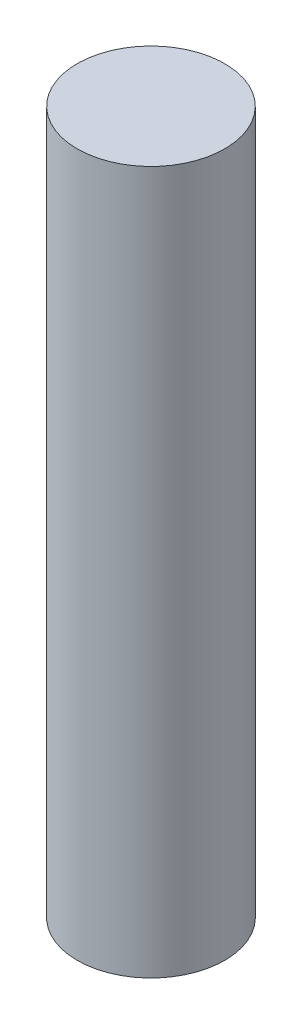
ISO-10303-21;
HEADER;
FILE_DESCRIPTION(('STEP AP214'),'2;1');
FILE_NAME('part.step','',(''),(''),'','','');
FILE_SCHEMA(('AUTOMOTIVE_DESIGN { 1 0 10303 214 1 1 1 1 }'));
ENDSEC;
DATA;
#1=APPLICATION_CONTEXT('core data for automotive mechanical design processes');
#2=APPLICATION_PROTOCOL_DEFINITION('international standard','automotive_design',2000,#1);
#3=PRODUCT_CONTEXT('',#1,'mechanical');
#4=PRODUCT('Part','Part','',(#3));
#5=PRODUCT_RELATED_PRODUCT_CATEGORY('part','',(#4));
#6=PRODUCT_DEFINITION_FORMATION('','',#4);
#7=PRODUCT_DEFINITION_CONTEXT('part definition',#1,'design');
#8=PRODUCT_DEFINITION('design','',#6,#7);
#9=PRODUCT_DEFINITION_SHAPE('','',#8);
#10=(LENGTH_UNIT() NAMED_UNIT(*) SI_UNIT(.MILLI.,.METRE.));
#11=(NAMED_UNIT(*) PLANE_ANGLE_UNIT() SI_UNIT($,.RADIAN.));
#12=(NAMED_UNIT(*) SI_UNIT($,.STERADIAN.) SOLID_ANGLE_UNIT());
#13=UNCERTAINTY_MEASURE_WITH_UNIT(LENGTH_MEASURE(1.E-05),#10,'distance_accuracy_value','');
#14=(GEOMETRIC_REPRESENTATION_CONTEXT(3) GLOBAL_UNCERTAINTY_ASSIGNED_CONTEXT((#13)) GLOBAL_UNIT_ASSIGNED_CONTEXT((#10,
#11,#12)) REPRESENTATION_CONTEXT('',''));
#15=CARTESIAN_POINT('',(0.,0.,0.));
#16=DIRECTION('',(0.,0.,1.));
#17=DIRECTION('',(1.,0.,0.));
#18=AXIS2_PLACEMENT_3D('',#15,#16,#17);
#19=CARTESIAN_POINT('',(0.,19.05,0.));
#20=DIRECTION('',(0.,-1.,0.));
#21=DIRECTION('',(0.,0.,-1.));
#22=AXIS2_PLACEMENT_3D('',#19,#20,#21);
#23=CYLINDRICAL_SURFACE('',#22,2.);
#24=CARTESIAN_POINT('',(0.,19.05,0.));
#25=DIRECTION('',(0.,1.,0.));
#26=DIRECTION('',(0.,0.,1.));
#27=AXIS2_PLACEMENT_3D('',#24,#25,#26);
#28=CIRCLE('',#27,2.);
#29=CARTESIAN_POINT('',(0.,19.05,2.));
#30=VERTEX_POINT('',#29);
#31=EDGE_CURVE('E10',#30,#30,#28,.T.);
#32=ORIENTED_EDGE('',*,*,#31,.F.);
#33=EDGE_LOOP('',(#32));
#34=FACE_BOUND('',#33,.T.);
#35=CARTESIAN_POINT('',(0.,0.,0.));
#36=DIRECTION('',(0.,1.,0.));
#37=DIRECTION('',(0.,0.,1.));
#38=AXIS2_PLACEMENT_3D('',#35,#36,#37);
#39=CIRCLE('',#38,2.);
#40=CARTESIAN_POINT('',(0.,0.,2.));
#41=VERTEX_POINT('',#40);
#42=EDGE_CURVE('E38',#41,#41,#39,.T.);
#43=ORIENTED_EDGE('',*,*,#42,.T.);
#44=EDGE_LOOP('',(#43));
#45=FACE_BOUND('',#44,.T.);
#46=ADVANCED_FACE('F35',(#34,#45),#23,.T.);
#47=CARTESIAN_POINT('',(0.,19.05,0.));
#48=DIRECTION('',(0.,1.,0.));
#49=DIRECTION('',(0.,0.,1.));
#50=AXIS2_PLACEMENT_3D('',#47,#48,#49);
#51=PLANE('',#50);
#52=ORIENTED_EDGE('',*,*,#31,.T.);
#53=EDGE_LOOP('',(#52));
#54=FACE_BOUND('',#53,.T.);
#55=ADVANCED_FACE('F50',(#54),#51,.T.);
#56=CARTESIAN_POINT('',(0.,0.,0.));
#57=DIRECTION('',(0.,1.,0.));
#58=DIRECTION('',(0.,0.,1.));
#59=AXIS2_PLACEMENT_3D('',#56,#57,#58);
#60=PLANE('',#59);
#61=ORIENTED_EDGE('',*,*,#42,.F.);
#62=EDGE_LOOP('',(#61));
#63=FACE_BOUND('',#62,.T.);
#64=ADVANCED_FACE('F48',(#63),#60,.F.);
#65=CLOSED_SHELL('',(#46,#55,#64));
#66=MANIFOLD_SOLID_BREP('B2',#65);
#67=ADVANCED_BREP_SHAPE_REPRESENTATION('',(#18,#66),#14);
#68=SHAPE_DEFINITION_REPRESENTATION(#9,#67);
ENDSEC;
END-ISO-10303-21;
